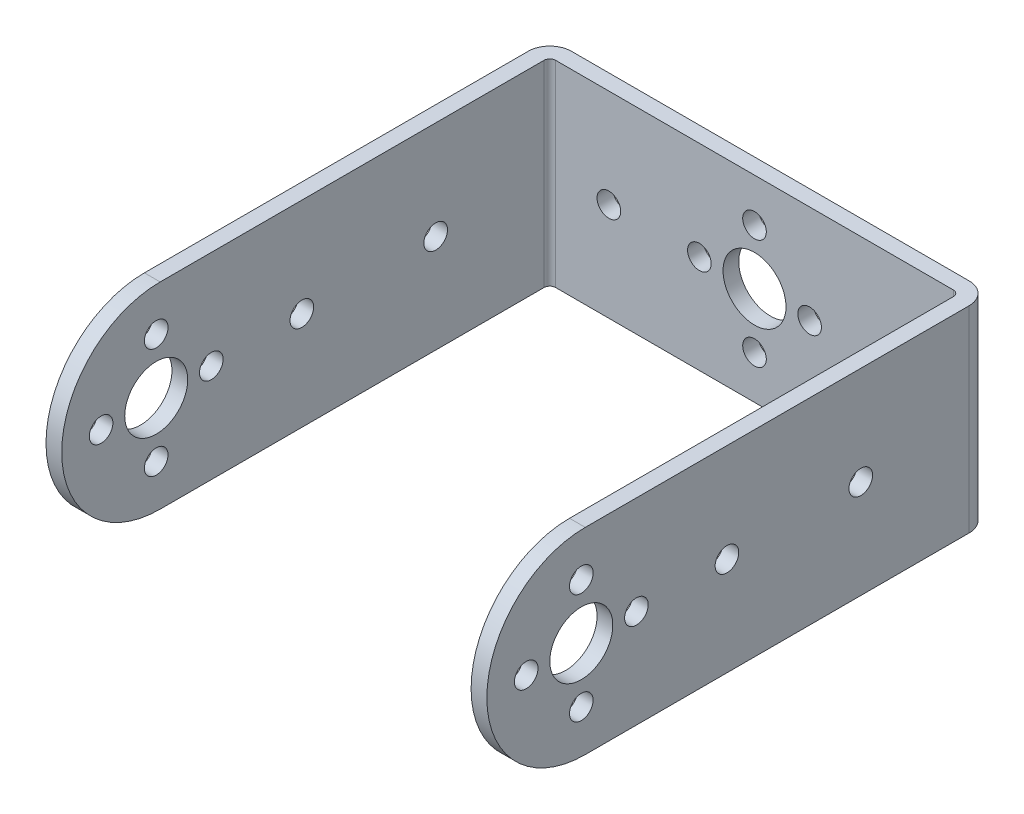
ISO-10303-21;
HEADER;
FILE_DESCRIPTION(('STEP AP214'),'2;1');
FILE_NAME('part.step','',(''),(''),'','','');
FILE_SCHEMA(('AUTOMOTIVE_DESIGN { 1 0 10303 214 1 1 1 1 }'));
ENDSEC;
DATA;
#1=APPLICATION_CONTEXT('core data for automotive mechanical design processes');
#2=APPLICATION_PROTOCOL_DEFINITION('international standard','automotive_design',2000,#1);
#3=PRODUCT_CONTEXT('',#1,'mechanical');
#4=PRODUCT('Part','Part','',(#3));
#5=PRODUCT_RELATED_PRODUCT_CATEGORY('part','',(#4));
#6=PRODUCT_DEFINITION_FORMATION('','',#4);
#7=PRODUCT_DEFINITION_CONTEXT('part definition',#1,'design');
#8=PRODUCT_DEFINITION('design','',#6,#7);
#9=PRODUCT_DEFINITION_SHAPE('','',#8);
#10=(LENGTH_UNIT() NAMED_UNIT(*) SI_UNIT(.MILLI.,.METRE.));
#11=(NAMED_UNIT(*) PLANE_ANGLE_UNIT() SI_UNIT($,.RADIAN.));
#12=(NAMED_UNIT(*) SI_UNIT($,.STERADIAN.) SOLID_ANGLE_UNIT());
#13=UNCERTAINTY_MEASURE_WITH_UNIT(LENGTH_MEASURE(1.E-05),#10,'distance_accuracy_value','');
#14=(GEOMETRIC_REPRESENTATION_CONTEXT(3) GLOBAL_UNCERTAINTY_ASSIGNED_CONTEXT((#13)) GLOBAL_UNIT_ASSIGNED_CONTEXT((#10,
#11,#12)) REPRESENTATION_CONTEXT('',''));
#15=CARTESIAN_POINT('',(0.,0.,0.));
#16=DIRECTION('',(0.,0.,1.));
#17=DIRECTION('',(1.,0.,0.));
#18=AXIS2_PLACEMENT_3D('',#15,#16,#17);
#19=CARTESIAN_POINT('',(1.,0.,0.));
#20=DIRECTION('',(-1.,0.,0.));
#21=DIRECTION('',(0.,0.,1.));
#22=AXIS2_PLACEMENT_3D('',#19,#20,#21);
#23=PLANE('',#22);
#24=CARTESIAN_POINT('',(0.999999999999826,-12.5,49.5000000000002));
#25=DIRECTION('',(-1.,0.,0.));
#26=DIRECTION('',(0.,0.,1.));
#27=AXIS2_PLACEMENT_3D('',#24,#25,#26);
#28=CIRCLE('',#27,12.5);
#29=CARTESIAN_POINT('',(0.999999999999917,-25.,49.5000000000002));
#30=VERTEX_POINT('',#29);
#31=CARTESIAN_POINT('',(0.999999999999826,0.,49.5000000000002));
#32=VERTEX_POINT('',#31);
#33=EDGE_CURVE('E103',#30,#32,#28,.T.);
#34=ORIENTED_EDGE('',*,*,#33,.F.);
#35=DIRECTION('',(0.,0.,1.));
#36=VECTOR('',#35,1.);
#37=CARTESIAN_POINT('',(1.,-25.,0.));
#38=LINE('',#37,#36);
#39=CARTESIAN_POINT('',(1.,-25.,0.736599999999996));
#40=VERTEX_POINT('',#39);
#41=EDGE_CURVE('E111',#40,#30,#38,.T.);
#42=ORIENTED_EDGE('',*,*,#41,.F.);
#43=DIRECTION('',(0.,-1.,0.));
#44=VECTOR('',#43,1.);
#45=CARTESIAN_POINT('',(1.,-25.,0.736599999999999));
#46=LINE('',#45,#44);
#47=CARTESIAN_POINT('',(0.999999999999912,0.,0.736599999999993));
#48=VERTEX_POINT('',#47);
#49=EDGE_CURVE('E133',#40,#48,#46,.F.);
#50=ORIENTED_EDGE('',*,*,#49,.T.);
#51=DIRECTION('',(0.,0.,1.));
#52=VECTOR('',#51,1.);
#53=CARTESIAN_POINT('',(0.999999999999827,0.,68.));
#54=LINE('',#53,#52);
#55=EDGE_CURVE('E113',#32,#48,#54,.F.);
#56=ORIENTED_EDGE('',*,*,#55,.F.);
#57=EDGE_LOOP('',(#34,#42,#50,#56));
#58=FACE_BOUND('',#57,.T.);
#59=CARTESIAN_POINT('',(0.999999999999888,-12.5,31.5000000000002));
#60=DIRECTION('',(-1.,0.,0.));
#61=DIRECTION('',(0.,0.,1.));
#62=AXIS2_PLACEMENT_3D('',#59,#60,#61);
#63=CIRCLE('',#62,1.5);
#64=CARTESIAN_POINT('',(0.999999999999883,-12.5,33.0000000000002));
#65=VERTEX_POINT('',#64);
#66=EDGE_CURVE('E116',#65,#65,#63,.T.);
#67=ORIENTED_EDGE('',*,*,#66,.T.);
#68=EDGE_LOOP('',(#67));
#69=FACE_BOUND('',#68,.T.);
#70=CARTESIAN_POINT('',(0.99999999999985,-12.5,43.0000000000001));
#71=DIRECTION('',(-1.,0.,0.));
#72=DIRECTION('',(0.,0.,1.));
#73=AXIS2_PLACEMENT_3D('',#70,#71,#72);
#74=CIRCLE('',#73,1.5);
#75=CARTESIAN_POINT('',(0.999999999999845,-12.5,44.5000000000001));
#76=VERTEX_POINT('',#75);
#77=EDGE_CURVE('E329',#76,#76,#74,.T.);
#78=ORIENTED_EDGE('',*,*,#77,.T.);
#79=EDGE_LOOP('',(#78));
#80=FACE_BOUND('',#79,.T.);
#81=CARTESIAN_POINT('',(0.999999999999801,-12.5,57.0000000000001));
#82=DIRECTION('',(-1.,0.,0.));
#83=DIRECTION('',(0.,0.,1.));
#84=AXIS2_PLACEMENT_3D('',#81,#82,#83);
#85=CIRCLE('',#84,1.5);
#86=CARTESIAN_POINT('',(0.999999999999796,-12.5,58.5000000000001));
#87=VERTEX_POINT('',#86);
#88=EDGE_CURVE('E333',#87,#87,#85,.T.);
#89=ORIENTED_EDGE('',*,*,#88,.T.);
#90=EDGE_LOOP('',(#89));
#91=FACE_BOUND('',#90,.T.);
#92=CARTESIAN_POINT('',(0.999999999999826,-12.5,50.0000000000001));
#93=DIRECTION('',(-1.,0.,0.));
#94=DIRECTION('',(0.,0.,1.));
#95=AXIS2_PLACEMENT_3D('',#92,#93,#94);
#96=CIRCLE('',#95,4.);
#97=CARTESIAN_POINT('',(0.999999999999812,-12.5,54.0000000000001));
#98=VERTEX_POINT('',#97);
#99=EDGE_CURVE('E337',#98,#98,#96,.T.);
#100=ORIENTED_EDGE('',*,*,#99,.T.);
#101=EDGE_LOOP('',(#100));
#102=FACE_BOUND('',#101,.T.);
#103=CARTESIAN_POINT('',(0.999999999999826,-5.5,50.0000000000001));
#104=DIRECTION('',(-1.,0.,0.));
#105=DIRECTION('',(0.,0.,1.));
#106=AXIS2_PLACEMENT_3D('',#103,#104,#105);
#107=CIRCLE('',#106,1.5);
#108=CARTESIAN_POINT('',(0.99999999999982,-5.5,51.5000000000001));
#109=VERTEX_POINT('',#108);
#110=EDGE_CURVE('E341',#109,#109,#107,.T.);
#111=ORIENTED_EDGE('',*,*,#110,.T.);
#112=EDGE_LOOP('',(#111));
#113=FACE_BOUND('',#112,.T.);
#114=CARTESIAN_POINT('',(0.999999999999829,-19.5,50.0000000000001));
#115=DIRECTION('',(-1.,0.,0.));
#116=DIRECTION('',(0.,0.,1.));
#117=AXIS2_PLACEMENT_3D('',#114,#115,#116);
#118=CIRCLE('',#117,1.5);
#119=CARTESIAN_POINT('',(0.999999999999824,-19.5,51.5000000000001));
#120=VERTEX_POINT('',#119);
#121=EDGE_CURVE('E344',#120,#120,#118,.T.);
#122=ORIENTED_EDGE('',*,*,#121,.T.);
#123=EDGE_LOOP('',(#122));
#124=FACE_BOUND('',#123,.T.);
#125=CARTESIAN_POINT('',(0.999999999999947,-12.5,14.5000000000002));
#126=DIRECTION('',(-1.,0.,0.));
#127=DIRECTION('',(0.,0.,1.));
#128=AXIS2_PLACEMENT_3D('',#125,#126,#127);
#129=CIRCLE('',#128,1.5);
#130=CARTESIAN_POINT('',(0.999999999999942,-12.5,16.0000000000002));
#131=VERTEX_POINT('',#130);
#132=EDGE_CURVE('E20',#131,#131,#129,.T.);
#133=ORIENTED_EDGE('',*,*,#132,.T.);
#134=EDGE_LOOP('',(#133));
#135=FACE_BOUND('',#134,.T.);
#136=ADVANCED_FACE('F17',(#58,#69,#80,#91,#102,#113,#124,#135),#23,.F.);
#137=CARTESIAN_POINT('',(-1.00000000000005,-12.5,14.5000000000002));
#138=DIRECTION('',(-1.,0.,0.));
#139=DIRECTION('',(0.,0.,1.));
#140=AXIS2_PLACEMENT_3D('',#137,#138,#139);
#141=CYLINDRICAL_SURFACE('',#140,1.5);
#142=CARTESIAN_POINT('',(-1.00000000000005,-12.5,14.5000000000002));
#143=DIRECTION('',(-1.,0.,0.));
#144=DIRECTION('',(0.,0.,1.));
#145=AXIS2_PLACEMENT_3D('',#142,#143,#144);
#146=CIRCLE('',#145,1.5);
#147=CARTESIAN_POINT('',(-1.00000000000006,-12.5,16.0000000000002));
#148=VERTEX_POINT('',#147);
#149=EDGE_CURVE('E137',#148,#148,#146,.F.);
#150=ORIENTED_EDGE('',*,*,#149,.F.);
#151=EDGE_LOOP('',(#150));
#152=FACE_BOUND('',#151,.T.);
#153=ORIENTED_EDGE('',*,*,#132,.F.);
#154=EDGE_LOOP('',(#153));
#155=FACE_BOUND('',#154,.T.);
#156=ADVANCED_FACE('F354',(#152,#155),#141,.F.);
#157=CARTESIAN_POINT('',(-1.00000000000017,-19.5,50.0000000000001));
#158=DIRECTION('',(-1.,0.,0.));
#159=DIRECTION('',(0.,0.,1.));
#160=AXIS2_PLACEMENT_3D('',#157,#158,#159);
#161=CYLINDRICAL_SURFACE('',#160,1.5);
#162=CARTESIAN_POINT('',(-1.00000000000017,-19.5,50.0000000000001));
#163=DIRECTION('',(-1.,0.,0.));
#164=DIRECTION('',(0.,0.,1.));
#165=AXIS2_PLACEMENT_3D('',#162,#163,#164);
#166=CIRCLE('',#165,1.5);
#167=CARTESIAN_POINT('',(-1.00000000000018,-19.5,51.5000000000001));
#168=VERTEX_POINT('',#167);
#169=EDGE_CURVE('E319',#168,#168,#166,.F.);
#170=ORIENTED_EDGE('',*,*,#169,.F.);
#171=EDGE_LOOP('',(#170));
#172=FACE_BOUND('',#171,.T.);
#173=ORIENTED_EDGE('',*,*,#121,.F.);
#174=EDGE_LOOP('',(#173));
#175=FACE_BOUND('',#174,.T.);
#176=ADVANCED_FACE('F356',(#172,#175),#161,.F.);
#177=CARTESIAN_POINT('',(-1.00000000000017,-5.5,50.0000000000001));
#178=DIRECTION('',(-1.,0.,0.));
#179=DIRECTION('',(0.,0.,1.));
#180=AXIS2_PLACEMENT_3D('',#177,#178,#179);
#181=CYLINDRICAL_SURFACE('',#180,1.5);
#182=CARTESIAN_POINT('',(-1.00000000000017,-5.5,50.0000000000001));
#183=DIRECTION('',(-1.,0.,0.));
#184=DIRECTION('',(0.,0.,1.));
#185=AXIS2_PLACEMENT_3D('',#182,#183,#184);
#186=CIRCLE('',#185,1.5);
#187=CARTESIAN_POINT('',(-1.00000000000018,-5.5,51.5000000000001));
#188=VERTEX_POINT('',#187);
#189=EDGE_CURVE('E315',#188,#188,#186,.F.);
#190=ORIENTED_EDGE('',*,*,#189,.F.);
#191=EDGE_LOOP('',(#190));
#192=FACE_BOUND('',#191,.T.);
#193=ORIENTED_EDGE('',*,*,#110,.F.);
#194=EDGE_LOOP('',(#193));
#195=FACE_BOUND('',#194,.T.);
#196=ADVANCED_FACE('F363',(#192,#195),#181,.F.);
#197=CARTESIAN_POINT('',(-1.00000000000017,-12.5,50.0000000000001));
#198=DIRECTION('',(-1.,0.,0.));
#199=DIRECTION('',(0.,0.,1.));
#200=AXIS2_PLACEMENT_3D('',#197,#198,#199);
#201=CYLINDRICAL_SURFACE('',#200,4.);
#202=CARTESIAN_POINT('',(-1.00000000000017,-12.5,50.0000000000001));
#203=DIRECTION('',(-1.,0.,0.));
#204=DIRECTION('',(0.,0.,1.));
#205=AXIS2_PLACEMENT_3D('',#202,#203,#204);
#206=CIRCLE('',#205,4.);
#207=CARTESIAN_POINT('',(-1.00000000000019,-12.5,54.0000000000001));
#208=VERTEX_POINT('',#207);
#209=EDGE_CURVE('E311',#208,#208,#206,.F.);
#210=ORIENTED_EDGE('',*,*,#209,.F.);
#211=EDGE_LOOP('',(#210));
#212=FACE_BOUND('',#211,.T.);
#213=ORIENTED_EDGE('',*,*,#99,.F.);
#214=EDGE_LOOP('',(#213));
#215=FACE_BOUND('',#214,.T.);
#216=ADVANCED_FACE('F485',(#212,#215),#201,.F.);
#217=CARTESIAN_POINT('',(-1.0000000000002,-12.5,57.0000000000001));
#218=DIRECTION('',(-1.,0.,0.));
#219=DIRECTION('',(0.,0.,1.));
#220=AXIS2_PLACEMENT_3D('',#217,#218,#219);
#221=CYLINDRICAL_SURFACE('',#220,1.5);
#222=CARTESIAN_POINT('',(-1.0000000000002,-12.5,57.0000000000001));
#223=DIRECTION('',(-1.,0.,0.));
#224=DIRECTION('',(0.,0.,1.));
#225=AXIS2_PLACEMENT_3D('',#222,#223,#224);
#226=CIRCLE('',#225,1.5);
#227=CARTESIAN_POINT('',(-1.0000000000002,-12.5,58.5000000000001));
#228=VERTEX_POINT('',#227);
#229=EDGE_CURVE('E307',#228,#228,#226,.F.);
#230=ORIENTED_EDGE('',*,*,#229,.F.);
#231=EDGE_LOOP('',(#230));
#232=FACE_BOUND('',#231,.T.);
#233=ORIENTED_EDGE('',*,*,#88,.F.);
#234=EDGE_LOOP('',(#233));
#235=FACE_BOUND('',#234,.T.);
#236=ADVANCED_FACE('F481',(#232,#235),#221,.F.);
#237=CARTESIAN_POINT('',(-1.00000000000015,-12.5,43.0000000000001));
#238=DIRECTION('',(-1.,0.,0.));
#239=DIRECTION('',(0.,0.,1.));
#240=AXIS2_PLACEMENT_3D('',#237,#238,#239);
#241=CYLINDRICAL_SURFACE('',#240,1.5);
#242=CARTESIAN_POINT('',(-1.00000000000015,-12.5,43.0000000000001));
#243=DIRECTION('',(-1.,0.,0.));
#244=DIRECTION('',(0.,0.,1.));
#245=AXIS2_PLACEMENT_3D('',#242,#243,#244);
#246=CIRCLE('',#245,1.5);
#247=CARTESIAN_POINT('',(-1.00000000000016,-12.5,44.5000000000001));
#248=VERTEX_POINT('',#247);
#249=EDGE_CURVE('E303',#248,#248,#246,.F.);
#250=ORIENTED_EDGE('',*,*,#249,.F.);
#251=EDGE_LOOP('',(#250));
#252=FACE_BOUND('',#251,.T.);
#253=ORIENTED_EDGE('',*,*,#77,.F.);
#254=EDGE_LOOP('',(#253));
#255=FACE_BOUND('',#254,.T.);
#256=ADVANCED_FACE('F477',(#252,#255),#241,.F.);
#257=CARTESIAN_POINT('',(-1.00000000000011,-12.5,31.5000000000002));
#258=DIRECTION('',(-1.,0.,0.));
#259=DIRECTION('',(0.,0.,1.));
#260=AXIS2_PLACEMENT_3D('',#257,#258,#259);
#261=CYLINDRICAL_SURFACE('',#260,1.5);
#262=CARTESIAN_POINT('',(-1.00000000000011,-12.5,31.5000000000002));
#263=DIRECTION('',(-1.,0.,0.));
#264=DIRECTION('',(0.,0.,1.));
#265=AXIS2_PLACEMENT_3D('',#262,#263,#264);
#266=CIRCLE('',#265,1.5);
#267=CARTESIAN_POINT('',(-1.00000000000012,-12.5,33.0000000000002));
#268=VERTEX_POINT('',#267);
#269=EDGE_CURVE('E299',#268,#268,#266,.F.);
#270=ORIENTED_EDGE('',*,*,#269,.F.);
#271=EDGE_LOOP('',(#270));
#272=FACE_BOUND('',#271,.T.);
#273=ORIENTED_EDGE('',*,*,#66,.F.);
#274=EDGE_LOOP('',(#273));
#275=FACE_BOUND('',#274,.T.);
#276=ADVANCED_FACE('F474',(#272,#275),#261,.F.);
#277=CARTESIAN_POINT('',(-1.00000000000017,-12.5,49.5000000000002));
#278=DIRECTION('',(-1.,0.,0.));
#279=DIRECTION('',(0.,0.,1.));
#280=AXIS2_PLACEMENT_3D('',#277,#278,#279);
#281=CYLINDRICAL_SURFACE('',#280,12.5);
#282=DIRECTION('',(-1.,0.,0.));
#283=VECTOR('',#282,1.);
#284=CARTESIAN_POINT('',(-1.00000000000024,0.,49.5000000000002));
#285=LINE('',#284,#283);
#286=CARTESIAN_POINT('',(-1.00000000000019,0.,49.5000000000002));
#287=VERTEX_POINT('',#286);
#288=EDGE_CURVE('E115',#287,#32,#285,.F.);
#289=ORIENTED_EDGE('',*,*,#288,.F.);
#290=CARTESIAN_POINT('',(-1.0000000000002,-12.5,49.5000000000002));
#291=DIRECTION('',(-1.,0.,0.));
#292=DIRECTION('',(0.,0.,1.));
#293=AXIS2_PLACEMENT_3D('',#290,#291,#292);
#294=CIRCLE('',#293,12.5);
#295=CARTESIAN_POINT('',(-1.00000000000017,-25.,49.5000000000002));
#296=VERTEX_POINT('',#295);
#297=EDGE_CURVE('E131',#296,#287,#294,.T.);
#298=ORIENTED_EDGE('',*,*,#297,.F.);
#299=DIRECTION('',(1.,0.,0.));
#300=VECTOR('',#299,1.);
#301=CARTESIAN_POINT('',(-0.999999999999997,-25.,49.5000000000002));
#302=LINE('',#301,#300);
#303=EDGE_CURVE('E123',#30,#296,#302,.F.);
#304=ORIENTED_EDGE('',*,*,#303,.F.);
#305=ORIENTED_EDGE('',*,*,#33,.T.);
#306=EDGE_LOOP('',(#289,#298,#304,#305));
#307=FACE_BOUND('',#306,.T.);
#308=ADVANCED_FACE('F130',(#307),#281,.T.);
#309=CARTESIAN_POINT('',(1.7366,-25.,0.736600000000001));
#310=DIRECTION('',(0.,-1.,0.));
#311=DIRECTION('',(1.,0.,0.));
#312=AXIS2_PLACEMENT_3D('',#309,#310,#311);
#313=CYLINDRICAL_SURFACE('',#312,0.736599999999998);
#314=CARTESIAN_POINT('',(1.7366,0.,0.7366));
#315=DIRECTION('',(0.,-1.,0.));
#316=DIRECTION('',(1.,0.,0.));
#317=AXIS2_PLACEMENT_3D('',#314,#315,#316);
#318=CIRCLE('',#317,0.736599999999998);
#319=CARTESIAN_POINT('',(1.73659999999999,0.,0.));
#320=VERTEX_POINT('',#319);
#321=EDGE_CURVE('E292',#48,#320,#318,.T.);
#322=ORIENTED_EDGE('',*,*,#321,.F.);
#323=ORIENTED_EDGE('',*,*,#49,.F.);
#324=CARTESIAN_POINT('',(1.7366,-25.,0.736600000000001));
#325=DIRECTION('',(0.,-1.,0.));
#326=DIRECTION('',(1.,0.,0.));
#327=AXIS2_PLACEMENT_3D('',#324,#325,#326);
#328=CIRCLE('',#327,0.736599999999998);
#329=CARTESIAN_POINT('',(1.7366,-25.,0.));
#330=VERTEX_POINT('',#329);
#331=EDGE_CURVE('E127',#40,#330,#328,.T.);
#332=ORIENTED_EDGE('',*,*,#331,.T.);
#333=DIRECTION('',(0.,1.,0.));
#334=VECTOR('',#333,1.);
#335=CARTESIAN_POINT('',(1.73659999999999,0.,0.));
#336=LINE('',#335,#334);
#337=EDGE_CURVE('E289',#320,#330,#336,.F.);
#338=ORIENTED_EDGE('',*,*,#337,.F.);
#339=EDGE_LOOP('',(#322,#323,#332,#338));
#340=FACE_BOUND('',#339,.T.);
#341=ADVANCED_FACE('F467',(#340),#313,.F.);
#342=CARTESIAN_POINT('',(-1.,0.,0.));
#343=DIRECTION('',(-1.,0.,0.));
#344=DIRECTION('',(0.,0.,1.));
#345=AXIS2_PLACEMENT_3D('',#342,#343,#344);
#346=PLANE('',#345);
#347=DIRECTION('',(0.,0.,1.));
#348=VECTOR('',#347,1.);
#349=CARTESIAN_POINT('',(-1.,0.,0.));
#350=LINE('',#349,#348);
#351=CARTESIAN_POINT('',(-1.,0.,0.73659999999999));
#352=VERTEX_POINT('',#351);
#353=EDGE_CURVE('E295',#287,#352,#350,.F.);
#354=ORIENTED_EDGE('',*,*,#353,.T.);
#355=DIRECTION('',(0.,-1.,0.));
#356=VECTOR('',#355,1.);
#357=CARTESIAN_POINT('',(-0.999999999999995,-25.,0.736599999999992));
#358=LINE('',#357,#356);
#359=CARTESIAN_POINT('',(-0.999999999999997,-25.,0.736599999999992));
#360=VERTEX_POINT('',#359);
#361=EDGE_CURVE('E257',#360,#352,#358,.F.);
#362=ORIENTED_EDGE('',*,*,#361,.F.);
#363=DIRECTION('',(0.,0.,1.));
#364=VECTOR('',#363,1.);
#365=CARTESIAN_POINT('',(-0.999999999999997,-25.,0.));
#366=LINE('',#365,#364);
#367=EDGE_CURVE('E298',#360,#296,#366,.T.);
#368=ORIENTED_EDGE('',*,*,#367,.T.);
#369=ORIENTED_EDGE('',*,*,#297,.T.);
#370=EDGE_LOOP('',(#354,#362,#368,#369));
#371=FACE_BOUND('',#370,.T.);
#372=ORIENTED_EDGE('',*,*,#269,.T.);
#373=EDGE_LOOP('',(#372));
#374=FACE_BOUND('',#373,.T.);
#375=ORIENTED_EDGE('',*,*,#249,.T.);
#376=EDGE_LOOP('',(#375));
#377=FACE_BOUND('',#376,.T.);
#378=ORIENTED_EDGE('',*,*,#229,.T.);
#379=EDGE_LOOP('',(#378));
#380=FACE_BOUND('',#379,.T.);
#381=ORIENTED_EDGE('',*,*,#209,.T.);
#382=EDGE_LOOP('',(#381));
#383=FACE_BOUND('',#382,.T.);
#384=ORIENTED_EDGE('',*,*,#189,.T.);
#385=EDGE_LOOP('',(#384));
#386=FACE_BOUND('',#385,.T.);
#387=ORIENTED_EDGE('',*,*,#169,.T.);
#388=EDGE_LOOP('',(#387));
#389=FACE_BOUND('',#388,.T.);
#390=ORIENTED_EDGE('',*,*,#149,.T.);
#391=EDGE_LOOP('',(#390));
#392=FACE_BOUND('',#391,.T.);
#393=ADVANCED_FACE('F463',(#371,#374,#377,#380,#383,#386,#389,#392),#346,.T.);
#394=CARTESIAN_POINT('',(0.,0.,0.));
#395=DIRECTION('',(0.,0.,1.));
#396=DIRECTION('',(1.,0.,0.));
#397=AXIS2_PLACEMENT_3D('',#394,#395,#396);
#398=PLANE('',#397);
#399=DIRECTION('',(1.,0.,0.));
#400=VECTOR('',#399,1.);
#401=CARTESIAN_POINT('',(0.,0.,0.));
#402=LINE('',#401,#400);
#403=CARTESIAN_POINT('',(52.2634,0.,0.));
#404=VERTEX_POINT('',#403);
#405=EDGE_CURVE('E256',#320,#404,#402,.T.);
#406=ORIENTED_EDGE('',*,*,#405,.F.);
#407=ORIENTED_EDGE('',*,*,#337,.T.);
#408=DIRECTION('',(1.,0.,0.));
#409=VECTOR('',#408,1.);
#410=CARTESIAN_POINT('',(0.,-25.,0.));
#411=LINE('',#410,#409);
#412=CARTESIAN_POINT('',(52.2634,-25.,0.));
#413=VERTEX_POINT('',#412);
#414=EDGE_CURVE('E762',#413,#330,#411,.F.);
#415=ORIENTED_EDGE('',*,*,#414,.F.);
#416=DIRECTION('',(0.,1.,0.));
#417=VECTOR('',#416,1.);
#418=CARTESIAN_POINT('',(52.2634,0.,0.));
#419=LINE('',#418,#417);
#420=EDGE_CURVE('E252',#413,#404,#419,.T.);
#421=ORIENTED_EDGE('',*,*,#420,.T.);
#422=EDGE_LOOP('',(#406,#407,#415,#421));
#423=FACE_BOUND('',#422,.T.);
#424=CARTESIAN_POINT('',(27.,-12.5,0.));
#425=DIRECTION('',(0.,0.,1.));
#426=DIRECTION('',(1.,0.,0.));
#427=AXIS2_PLACEMENT_3D('',#424,#425,#426);
#428=CIRCLE('',#427,4.);
#429=CARTESIAN_POINT('',(31.,-12.5,0.));
#430=VERTEX_POINT('',#429);
#431=EDGE_CURVE('E261',#430,#430,#428,.F.);
#432=ORIENTED_EDGE('',*,*,#431,.T.);
#433=EDGE_LOOP('',(#432));
#434=FACE_BOUND('',#433,.T.);
#435=CARTESIAN_POINT('',(27.,-5.5,0.));
#436=DIRECTION('',(0.,0.,1.));
#437=DIRECTION('',(1.,0.,0.));
#438=AXIS2_PLACEMENT_3D('',#435,#436,#437);
#439=CIRCLE('',#438,1.5);
#440=CARTESIAN_POINT('',(28.5,-5.5,0.));
#441=VERTEX_POINT('',#440);
#442=EDGE_CURVE('E265',#441,#441,#439,.F.);
#443=ORIENTED_EDGE('',*,*,#442,.T.);
#444=EDGE_LOOP('',(#443));
#445=FACE_BOUND('',#444,.T.);
#446=CARTESIAN_POINT('',(27.,-19.5,0.));
#447=DIRECTION('',(0.,0.,1.));
#448=DIRECTION('',(1.,0.,0.));
#449=AXIS2_PLACEMENT_3D('',#446,#447,#448);
#450=CIRCLE('',#449,1.5);
#451=CARTESIAN_POINT('',(28.5,-19.5,0.));
#452=VERTEX_POINT('',#451);
#453=EDGE_CURVE('E269',#452,#452,#450,.F.);
#454=ORIENTED_EDGE('',*,*,#453,.T.);
#455=EDGE_LOOP('',(#454));
#456=FACE_BOUND('',#455,.T.);
#457=CARTESIAN_POINT('',(34.,-12.5,0.));
#458=DIRECTION('',(0.,0.,1.));
#459=DIRECTION('',(1.,0.,0.));
#460=AXIS2_PLACEMENT_3D('',#457,#458,#459);
#461=CIRCLE('',#460,1.5);
#462=CARTESIAN_POINT('',(35.5,-12.5,0.));
#463=VERTEX_POINT('',#462);
#464=EDGE_CURVE('E273',#463,#463,#461,.F.);
#465=ORIENTED_EDGE('',*,*,#464,.T.);
#466=EDGE_LOOP('',(#465));
#467=FACE_BOUND('',#466,.T.);
#468=CARTESIAN_POINT('',(20.,-12.5,0.));
#469=DIRECTION('',(0.,0.,1.));
#470=DIRECTION('',(1.,0.,0.));
#471=AXIS2_PLACEMENT_3D('',#468,#469,#470);
#472=CIRCLE('',#471,1.5);
#473=CARTESIAN_POINT('',(21.5,-12.5,0.));
#474=VERTEX_POINT('',#473);
#475=EDGE_CURVE('E277',#474,#474,#472,.F.);
#476=ORIENTED_EDGE('',*,*,#475,.T.);
#477=EDGE_LOOP('',(#476));
#478=FACE_BOUND('',#477,.T.);
#479=CARTESIAN_POINT('',(45.5,-12.5,0.));
#480=DIRECTION('',(0.,0.,1.));
#481=DIRECTION('',(1.,0.,0.));
#482=AXIS2_PLACEMENT_3D('',#479,#480,#481);
#483=CIRCLE('',#482,1.5);
#484=CARTESIAN_POINT('',(47.,-12.5,0.));
#485=VERTEX_POINT('',#484);
#486=EDGE_CURVE('E281',#485,#485,#483,.F.);
#487=ORIENTED_EDGE('',*,*,#486,.T.);
#488=EDGE_LOOP('',(#487));
#489=FACE_BOUND('',#488,.T.);
#490=CARTESIAN_POINT('',(8.5,-12.5,0.));
#491=DIRECTION('',(0.,0.,1.));
#492=DIRECTION('',(1.,0.,0.));
#493=AXIS2_PLACEMENT_3D('',#490,#491,#492);
#494=CIRCLE('',#493,1.5);
#495=CARTESIAN_POINT('',(10.,-12.5,0.));
#496=VERTEX_POINT('',#495);
#497=EDGE_CURVE('E285',#496,#496,#494,.F.);
#498=ORIENTED_EDGE('',*,*,#497,.T.);
#499=EDGE_LOOP('',(#498));
#500=FACE_BOUND('',#499,.T.);
#501=ADVANCED_FACE('F459',(#423,#434,#445,#456,#467,#478,#489,#500),#398,.T.);
#502=CARTESIAN_POINT('',(8.5,-12.5,-2.));
#503=DIRECTION('',(0.,0.,1.));
#504=DIRECTION('',(1.,0.,0.));
#505=AXIS2_PLACEMENT_3D('',#502,#503,#504);
#506=CYLINDRICAL_SURFACE('',#505,1.5);
#507=CARTESIAN_POINT('',(8.5,-12.5,-2.));
#508=DIRECTION('',(0.,0.,1.));
#509=DIRECTION('',(1.,0.,0.));
#510=AXIS2_PLACEMENT_3D('',#507,#508,#509);
#511=CIRCLE('',#510,1.5);
#512=CARTESIAN_POINT('',(10.,-12.5,-2.));
#513=VERTEX_POINT('',#512);
#514=EDGE_CURVE('E248',#513,#513,#511,.F.);
#515=ORIENTED_EDGE('',*,*,#514,.T.);
#516=EDGE_LOOP('',(#515));
#517=FACE_BOUND('',#516,.T.);
#518=ORIENTED_EDGE('',*,*,#497,.F.);
#519=EDGE_LOOP('',(#518));
#520=FACE_BOUND('',#519,.T.);
#521=ADVANCED_FACE('F455',(#517,#520),#506,.F.);
#522=CARTESIAN_POINT('',(45.5,-12.5,-2.));
#523=DIRECTION('',(0.,0.,1.));
#524=DIRECTION('',(1.,0.,0.));
#525=AXIS2_PLACEMENT_3D('',#522,#523,#524);
#526=CYLINDRICAL_SURFACE('',#525,1.5);
#527=CARTESIAN_POINT('',(45.5,-12.5,-2.));
#528=DIRECTION('',(0.,0.,1.));
#529=DIRECTION('',(1.,0.,0.));
#530=AXIS2_PLACEMENT_3D('',#527,#528,#529);
#531=CIRCLE('',#530,1.5);
#532=CARTESIAN_POINT('',(47.,-12.5,-2.));
#533=VERTEX_POINT('',#532);
#534=EDGE_CURVE('E244',#533,#533,#531,.F.);
#535=ORIENTED_EDGE('',*,*,#534,.T.);
#536=EDGE_LOOP('',(#535));
#537=FACE_BOUND('',#536,.T.);
#538=ORIENTED_EDGE('',*,*,#486,.F.);
#539=EDGE_LOOP('',(#538));
#540=FACE_BOUND('',#539,.T.);
#541=ADVANCED_FACE('F451',(#537,#540),#526,.F.);
#542=CARTESIAN_POINT('',(20.,-12.5,-2.));
#543=DIRECTION('',(0.,0.,1.));
#544=DIRECTION('',(1.,0.,0.));
#545=AXIS2_PLACEMENT_3D('',#542,#543,#544);
#546=CYLINDRICAL_SURFACE('',#545,1.5);
#547=CARTESIAN_POINT('',(20.,-12.5,-2.));
#548=DIRECTION('',(0.,0.,1.));
#549=DIRECTION('',(1.,0.,0.));
#550=AXIS2_PLACEMENT_3D('',#547,#548,#549);
#551=CIRCLE('',#550,1.5);
#552=CARTESIAN_POINT('',(21.5,-12.5,-2.));
#553=VERTEX_POINT('',#552);
#554=EDGE_CURVE('E240',#553,#553,#551,.F.);
#555=ORIENTED_EDGE('',*,*,#554,.T.);
#556=EDGE_LOOP('',(#555));
#557=FACE_BOUND('',#556,.T.);
#558=ORIENTED_EDGE('',*,*,#475,.F.);
#559=EDGE_LOOP('',(#558));
#560=FACE_BOUND('',#559,.T.);
#561=ADVANCED_FACE('F447',(#557,#560),#546,.F.);
#562=CARTESIAN_POINT('',(34.,-12.5,-2.));
#563=DIRECTION('',(0.,0.,1.));
#564=DIRECTION('',(1.,0.,0.));
#565=AXIS2_PLACEMENT_3D('',#562,#563,#564);
#566=CYLINDRICAL_SURFACE('',#565,1.5);
#567=CARTESIAN_POINT('',(34.,-12.5,-2.));
#568=DIRECTION('',(0.,0.,1.));
#569=DIRECTION('',(1.,0.,0.));
#570=AXIS2_PLACEMENT_3D('',#567,#568,#569);
#571=CIRCLE('',#570,1.5);
#572=CARTESIAN_POINT('',(35.5,-12.5,-2.));
#573=VERTEX_POINT('',#572);
#574=EDGE_CURVE('E236',#573,#573,#571,.F.);
#575=ORIENTED_EDGE('',*,*,#574,.T.);
#576=EDGE_LOOP('',(#575));
#577=FACE_BOUND('',#576,.T.);
#578=ORIENTED_EDGE('',*,*,#464,.F.);
#579=EDGE_LOOP('',(#578));
#580=FACE_BOUND('',#579,.T.);
#581=ADVANCED_FACE('F443',(#577,#580),#566,.F.);
#582=CARTESIAN_POINT('',(27.,-19.5,-2.));
#583=DIRECTION('',(0.,0.,1.));
#584=DIRECTION('',(1.,0.,0.));
#585=AXIS2_PLACEMENT_3D('',#582,#583,#584);
#586=CYLINDRICAL_SURFACE('',#585,1.5);
#587=CARTESIAN_POINT('',(27.,-19.5,-2.));
#588=DIRECTION('',(0.,0.,1.));
#589=DIRECTION('',(1.,0.,0.));
#590=AXIS2_PLACEMENT_3D('',#587,#588,#589);
#591=CIRCLE('',#590,1.5);
#592=CARTESIAN_POINT('',(28.5,-19.5,-2.));
#593=VERTEX_POINT('',#592);
#594=EDGE_CURVE('E232',#593,#593,#591,.F.);
#595=ORIENTED_EDGE('',*,*,#594,.T.);
#596=EDGE_LOOP('',(#595));
#597=FACE_BOUND('',#596,.T.);
#598=ORIENTED_EDGE('',*,*,#453,.F.);
#599=EDGE_LOOP('',(#598));
#600=FACE_BOUND('',#599,.T.);
#601=ADVANCED_FACE('F439',(#597,#600),#586,.F.);
#602=CARTESIAN_POINT('',(27.,-5.5,-2.));
#603=DIRECTION('',(0.,0.,1.));
#604=DIRECTION('',(1.,0.,0.));
#605=AXIS2_PLACEMENT_3D('',#602,#603,#604);
#606=CYLINDRICAL_SURFACE('',#605,1.5);
#607=CARTESIAN_POINT('',(27.,-5.5,-2.));
#608=DIRECTION('',(0.,0.,1.));
#609=DIRECTION('',(1.,0.,0.));
#610=AXIS2_PLACEMENT_3D('',#607,#608,#609);
#611=CIRCLE('',#610,1.5);
#612=CARTESIAN_POINT('',(28.5,-5.5,-2.));
#613=VERTEX_POINT('',#612);
#614=EDGE_CURVE('E228',#613,#613,#611,.F.);
#615=ORIENTED_EDGE('',*,*,#614,.T.);
#616=EDGE_LOOP('',(#615));
#617=FACE_BOUND('',#616,.T.);
#618=ORIENTED_EDGE('',*,*,#442,.F.);
#619=EDGE_LOOP('',(#618));
#620=FACE_BOUND('',#619,.T.);
#621=ADVANCED_FACE('F435',(#617,#620),#606,.F.);
#622=CARTESIAN_POINT('',(27.,-12.5,-2.));
#623=DIRECTION('',(0.,0.,1.));
#624=DIRECTION('',(1.,0.,0.));
#625=AXIS2_PLACEMENT_3D('',#622,#623,#624);
#626=CYLINDRICAL_SURFACE('',#625,4.);
#627=CARTESIAN_POINT('',(27.,-12.5,-2.));
#628=DIRECTION('',(0.,0.,1.));
#629=DIRECTION('',(1.,0.,0.));
#630=AXIS2_PLACEMENT_3D('',#627,#628,#629);
#631=CIRCLE('',#630,4.);
#632=CARTESIAN_POINT('',(31.,-12.5,-2.));
#633=VERTEX_POINT('',#632);
#634=EDGE_CURVE('E223',#633,#633,#631,.F.);
#635=ORIENTED_EDGE('',*,*,#634,.T.);
#636=EDGE_LOOP('',(#635));
#637=FACE_BOUND('',#636,.T.);
#638=ORIENTED_EDGE('',*,*,#431,.F.);
#639=EDGE_LOOP('',(#638));
#640=FACE_BOUND('',#639,.T.);
#641=ADVANCED_FACE('F431',(#637,#640),#626,.F.);
#642=CARTESIAN_POINT('',(1.7366,-25.,0.736600000000001));
#643=DIRECTION('',(0.,-1.,0.));
#644=DIRECTION('',(1.,0.,0.));
#645=AXIS2_PLACEMENT_3D('',#642,#643,#644);
#646=CYLINDRICAL_SURFACE('',#645,2.7366);
#647=ORIENTED_EDGE('',*,*,#361,.T.);
#648=CARTESIAN_POINT('',(1.7366,0.,0.7366));
#649=DIRECTION('',(0.,-1.,0.));
#650=DIRECTION('',(1.,0.,0.));
#651=AXIS2_PLACEMENT_3D('',#648,#649,#650);
#652=CIRCLE('',#651,2.7366);
#653=CARTESIAN_POINT('',(1.73659999999999,0.,-2.));
#654=VERTEX_POINT('',#653);
#655=EDGE_CURVE('E253',#352,#654,#652,.T.);
#656=ORIENTED_EDGE('',*,*,#655,.T.);
#657=DIRECTION('',(0.,1.,0.));
#658=VECTOR('',#657,1.);
#659=CARTESIAN_POINT('',(1.73659999999999,0.,-2.));
#660=LINE('',#659,#658);
#661=CARTESIAN_POINT('',(1.7366,-25.,-2.));
#662=VERTEX_POINT('',#661);
#663=EDGE_CURVE('E756',#654,#662,#660,.F.);
#664=ORIENTED_EDGE('',*,*,#663,.T.);
#665=CARTESIAN_POINT('',(1.7366,-25.,0.736600000000001));
#666=DIRECTION('',(0.,-1.,0.));
#667=DIRECTION('',(1.,0.,0.));
#668=AXIS2_PLACEMENT_3D('',#665,#666,#667);
#669=CIRCLE('',#668,2.7366);
#670=EDGE_CURVE('E258',#662,#360,#669,.F.);
#671=ORIENTED_EDGE('',*,*,#670,.T.);
#672=EDGE_LOOP('',(#647,#656,#664,#671));
#673=FACE_BOUND('',#672,.T.);
#674=ADVANCED_FACE('F427',(#673),#646,.T.);
#675=CARTESIAN_POINT('',(52.2634,0.,0.7366));
#676=DIRECTION('',(0.,1.,0.));
#677=DIRECTION('',(0.,0.,1.));
#678=AXIS2_PLACEMENT_3D('',#675,#676,#677);
#679=CYLINDRICAL_SURFACE('',#678,0.736599999999997);
#680=CARTESIAN_POINT('',(52.2634,-25.,0.7366));
#681=DIRECTION('',(0.,1.,0.));
#682=DIRECTION('',(0.,0.,1.));
#683=AXIS2_PLACEMENT_3D('',#680,#681,#682);
#684=CIRCLE('',#683,0.736599999999997);
#685=CARTESIAN_POINT('',(53.0000000000001,-25.,0.736599999999998));
#686=VERTEX_POINT('',#685);
#687=EDGE_CURVE('E214',#686,#413,#684,.T.);
#688=ORIENTED_EDGE('',*,*,#687,.F.);
#689=DIRECTION('',(0.,1.,0.));
#690=VECTOR('',#689,1.);
#691=CARTESIAN_POINT('',(53.,0.,0.736599999999997));
#692=LINE('',#691,#690);
#693=CARTESIAN_POINT('',(53.,0.,0.736599999999995));
#694=VERTEX_POINT('',#693);
#695=EDGE_CURVE('E213',#694,#686,#692,.F.);
#696=ORIENTED_EDGE('',*,*,#695,.F.);
#697=CARTESIAN_POINT('',(52.2634,0.,0.7366));
#698=DIRECTION('',(0.,1.,0.));
#699=DIRECTION('',(0.,0.,1.));
#700=AXIS2_PLACEMENT_3D('',#697,#698,#699);
#701=CIRCLE('',#700,0.736599999999997);
#702=EDGE_CURVE('E218',#694,#404,#701,.T.);
#703=ORIENTED_EDGE('',*,*,#702,.T.);
#704=ORIENTED_EDGE('',*,*,#420,.F.);
#705=EDGE_LOOP('',(#688,#696,#703,#704));
#706=FACE_BOUND('',#705,.T.);
#707=ADVANCED_FACE('F423',(#706),#679,.F.);
#708=CARTESIAN_POINT('',(0.,0.,-2.));
#709=DIRECTION('',(0.,0.,1.));
#710=DIRECTION('',(1.,0.,0.));
#711=AXIS2_PLACEMENT_3D('',#708,#709,#710);
#712=PLANE('',#711);
#713=DIRECTION('',(1.,0.,0.));
#714=VECTOR('',#713,1.);
#715=CARTESIAN_POINT('',(0.,-25.,-2.));
#716=LINE('',#715,#714);
#717=CARTESIAN_POINT('',(52.2634,-25.,-2.));
#718=VERTEX_POINT('',#717);
#719=EDGE_CURVE('E222',#662,#718,#716,.T.);
#720=ORIENTED_EDGE('',*,*,#719,.F.);
#721=ORIENTED_EDGE('',*,*,#663,.F.);
#722=DIRECTION('',(1.,0.,0.));
#723=VECTOR('',#722,1.);
#724=CARTESIAN_POINT('',(0.,0.,-2.));
#725=LINE('',#724,#723);
#726=CARTESIAN_POINT('',(52.2634,0.,-2.));
#727=VERTEX_POINT('',#726);
#728=EDGE_CURVE('E227',#727,#654,#725,.F.);
#729=ORIENTED_EDGE('',*,*,#728,.F.);
#730=DIRECTION('',(0.,1.,0.));
#731=VECTOR('',#730,1.);
#732=CARTESIAN_POINT('',(52.2634,0.,-2.));
#733=LINE('',#732,#731);
#734=EDGE_CURVE('E183',#718,#727,#733,.T.);
#735=ORIENTED_EDGE('',*,*,#734,.F.);
#736=EDGE_LOOP('',(#720,#721,#729,#735));
#737=FACE_BOUND('',#736,.T.);
#738=ORIENTED_EDGE('',*,*,#634,.F.);
#739=EDGE_LOOP('',(#738));
#740=FACE_BOUND('',#739,.T.);
#741=ORIENTED_EDGE('',*,*,#614,.F.);
#742=EDGE_LOOP('',(#741));
#743=FACE_BOUND('',#742,.T.);
#744=ORIENTED_EDGE('',*,*,#594,.F.);
#745=EDGE_LOOP('',(#744));
#746=FACE_BOUND('',#745,.T.);
#747=ORIENTED_EDGE('',*,*,#574,.F.);
#748=EDGE_LOOP('',(#747));
#749=FACE_BOUND('',#748,.T.);
#750=ORIENTED_EDGE('',*,*,#554,.F.);
#751=EDGE_LOOP('',(#750));
#752=FACE_BOUND('',#751,.T.);
#753=ORIENTED_EDGE('',*,*,#534,.F.);
#754=EDGE_LOOP('',(#753));
#755=FACE_BOUND('',#754,.T.);
#756=ORIENTED_EDGE('',*,*,#514,.F.);
#757=EDGE_LOOP('',(#756));
#758=FACE_BOUND('',#757,.T.);
#759=ADVANCED_FACE('F419',(#737,#740,#743,#746,#749,#752,#755,#758),#712,.F.);
#760=CARTESIAN_POINT('',(53.,0.,-1.87350135405495E-13));
#761=DIRECTION('',(-1.,0.,0.));
#762=DIRECTION('',(0.,0.,1.));
#763=AXIS2_PLACEMENT_3D('',#760,#761,#762);
#764=PLANE('',#763);
#765=DIRECTION('',(0.,0.,1.));
#766=VECTOR('',#765,1.);
#767=CARTESIAN_POINT('',(53.,0.,68.));
#768=LINE('',#767,#766);
#769=CARTESIAN_POINT('',(53.0000000000001,0.,49.5));
#770=VERTEX_POINT('',#769);
#771=EDGE_CURVE('E188',#694,#770,#768,.T.);
#772=ORIENTED_EDGE('',*,*,#771,.F.);
#773=ORIENTED_EDGE('',*,*,#695,.T.);
#774=DIRECTION('',(0.,0.,-1.));
#775=VECTOR('',#774,1.);
#776=CARTESIAN_POINT('',(53.0000000000002,-25.,0.));
#777=LINE('',#776,#775);
#778=CARTESIAN_POINT('',(53.0000000000002,-25.,49.5));
#779=VERTEX_POINT('',#778);
#780=EDGE_CURVE('E179',#779,#686,#777,.T.);
#781=ORIENTED_EDGE('',*,*,#780,.F.);
#782=CARTESIAN_POINT('',(53.0000000000002,-12.5,49.5));
#783=DIRECTION('',(-1.,0.,0.));
#784=DIRECTION('',(0.,0.,1.));
#785=AXIS2_PLACEMENT_3D('',#782,#783,#784);
#786=CIRCLE('',#785,12.5);
#787=EDGE_CURVE('E171',#770,#779,#786,.F.);
#788=ORIENTED_EDGE('',*,*,#787,.F.);
#789=EDGE_LOOP('',(#772,#773,#781,#788));
#790=FACE_BOUND('',#789,.T.);
#791=CARTESIAN_POINT('',(53.0000000000001,-12.5,31.5));
#792=DIRECTION('',(-1.,0.,0.));
#793=DIRECTION('',(0.,0.,1.));
#794=AXIS2_PLACEMENT_3D('',#791,#792,#793);
#795=CIRCLE('',#794,1.5);
#796=CARTESIAN_POINT('',(53.0000000000001,-12.5,33.));
#797=VERTEX_POINT('',#796);
#798=EDGE_CURVE('E184',#797,#797,#795,.F.);
#799=ORIENTED_EDGE('',*,*,#798,.T.);
#800=EDGE_LOOP('',(#799));
#801=FACE_BOUND('',#800,.T.);
#802=CARTESIAN_POINT('',(53.0000000000001,-12.5,42.9999999999999));
#803=DIRECTION('',(-1.,0.,0.));
#804=DIRECTION('',(0.,0.,1.));
#805=AXIS2_PLACEMENT_3D('',#802,#803,#804);
#806=CIRCLE('',#805,1.5);
#807=CARTESIAN_POINT('',(53.0000000000002,-12.5,44.4999999999999));
#808=VERTEX_POINT('',#807);
#809=EDGE_CURVE('E189',#808,#808,#806,.F.);
#810=ORIENTED_EDGE('',*,*,#809,.T.);
#811=EDGE_LOOP('',(#810));
#812=FACE_BOUND('',#811,.T.);
#813=CARTESIAN_POINT('',(53.0000000000002,-12.5,56.9999999999999));
#814=DIRECTION('',(-1.,0.,0.));
#815=DIRECTION('',(0.,0.,1.));
#816=AXIS2_PLACEMENT_3D('',#813,#814,#815);
#817=CIRCLE('',#816,1.5);
#818=CARTESIAN_POINT('',(53.0000000000002,-12.5,58.4999999999999));
#819=VERTEX_POINT('',#818);
#820=EDGE_CURVE('E193',#819,#819,#817,.F.);
#821=ORIENTED_EDGE('',*,*,#820,.T.);
#822=EDGE_LOOP('',(#821));
#823=FACE_BOUND('',#822,.T.);
#824=CARTESIAN_POINT('',(53.0000000000002,-12.5,49.9999999999999));
#825=DIRECTION('',(-1.,0.,0.));
#826=DIRECTION('',(0.,0.,1.));
#827=AXIS2_PLACEMENT_3D('',#824,#825,#826);
#828=CIRCLE('',#827,4.);
#829=CARTESIAN_POINT('',(53.0000000000002,-12.5,53.9999999999999));
#830=VERTEX_POINT('',#829);
#831=EDGE_CURVE('E197',#830,#830,#828,.F.);
#832=ORIENTED_EDGE('',*,*,#831,.T.);
#833=EDGE_LOOP('',(#832));
#834=FACE_BOUND('',#833,.T.);
#835=CARTESIAN_POINT('',(53.0000000000002,-5.5,49.9999999999999));
#836=DIRECTION('',(-1.,0.,0.));
#837=DIRECTION('',(0.,0.,1.));
#838=AXIS2_PLACEMENT_3D('',#835,#836,#837);
#839=CIRCLE('',#838,1.5);
#840=CARTESIAN_POINT('',(53.0000000000002,-5.5,51.4999999999999));
#841=VERTEX_POINT('',#840);
#842=EDGE_CURVE('E201',#841,#841,#839,.F.);
#843=ORIENTED_EDGE('',*,*,#842,.T.);
#844=EDGE_LOOP('',(#843));
#845=FACE_BOUND('',#844,.T.);
#846=CARTESIAN_POINT('',(53.0000000000002,-19.5,49.9999999999999));
#847=DIRECTION('',(-1.,0.,0.));
#848=DIRECTION('',(0.,0.,1.));
#849=AXIS2_PLACEMENT_3D('',#846,#847,#848);
#850=CIRCLE('',#849,1.5);
#851=CARTESIAN_POINT('',(53.0000000000002,-19.5,51.4999999999999));
#852=VERTEX_POINT('',#851);
#853=EDGE_CURVE('E205',#852,#852,#850,.F.);
#854=ORIENTED_EDGE('',*,*,#853,.T.);
#855=EDGE_LOOP('',(#854));
#856=FACE_BOUND('',#855,.T.);
#857=CARTESIAN_POINT('',(53.0000000000001,-12.5,14.5));
#858=DIRECTION('',(-1.,0.,0.));
#859=DIRECTION('',(0.,0.,1.));
#860=AXIS2_PLACEMENT_3D('',#857,#858,#859);
#861=CIRCLE('',#860,1.5);
#862=CARTESIAN_POINT('',(53.0000000000001,-12.5,16.));
#863=VERTEX_POINT('',#862);
#864=EDGE_CURVE('E209',#863,#863,#861,.F.);
#865=ORIENTED_EDGE('',*,*,#864,.T.);
#866=EDGE_LOOP('',(#865));
#867=FACE_BOUND('',#866,.T.);
#868=ADVANCED_FACE('F415',(#790,#801,#812,#823,#834,#845,#856,#867),#764,.T.);
#869=CARTESIAN_POINT('',(53.0000000000001,-12.5,14.5));
#870=DIRECTION('',(-1.,0.,0.));
#871=DIRECTION('',(0.,0.,1.));
#872=AXIS2_PLACEMENT_3D('',#869,#870,#871);
#873=CYLINDRICAL_SURFACE('',#872,1.5);
#874=CARTESIAN_POINT('',(55.,-12.5,14.5));
#875=DIRECTION('',(-1.,0.,0.));
#876=DIRECTION('',(0.,0.,1.));
#877=AXIS2_PLACEMENT_3D('',#874,#875,#876);
#878=CIRCLE('',#877,1.5);
#879=CARTESIAN_POINT('',(55.0000000000001,-12.5,16.));
#880=VERTEX_POINT('',#879);
#881=EDGE_CURVE('E167',#880,#880,#878,.F.);
#882=ORIENTED_EDGE('',*,*,#881,.T.);
#883=EDGE_LOOP('',(#882));
#884=FACE_BOUND('',#883,.T.);
#885=ORIENTED_EDGE('',*,*,#864,.F.);
#886=EDGE_LOOP('',(#885));
#887=FACE_BOUND('',#886,.T.);
#888=ADVANCED_FACE('F411',(#884,#887),#873,.F.);
#889=CARTESIAN_POINT('',(53.0000000000002,-19.5,49.9999999999999));
#890=DIRECTION('',(-1.,0.,0.));
#891=DIRECTION('',(0.,0.,1.));
#892=AXIS2_PLACEMENT_3D('',#889,#890,#891);
#893=CYLINDRICAL_SURFACE('',#892,1.5);
#894=CARTESIAN_POINT('',(55.0000000000002,-19.5,49.9999999999999));
#895=DIRECTION('',(-1.,0.,0.));
#896=DIRECTION('',(0.,0.,1.));
#897=AXIS2_PLACEMENT_3D('',#894,#895,#896);
#898=CIRCLE('',#897,1.5);
#899=CARTESIAN_POINT('',(55.0000000000002,-19.5,51.4999999999999));
#900=VERTEX_POINT('',#899);
#901=EDGE_CURVE('E163',#900,#900,#898,.F.);
#902=ORIENTED_EDGE('',*,*,#901,.T.);
#903=EDGE_LOOP('',(#902));
#904=FACE_BOUND('',#903,.T.);
#905=ORIENTED_EDGE('',*,*,#853,.F.);
#906=EDGE_LOOP('',(#905));
#907=FACE_BOUND('',#906,.T.);
#908=ADVANCED_FACE('F407',(#904,#907),#893,.F.);
#909=CARTESIAN_POINT('',(53.0000000000002,-5.5,49.9999999999999));
#910=DIRECTION('',(-1.,0.,0.));
#911=DIRECTION('',(0.,0.,1.));
#912=AXIS2_PLACEMENT_3D('',#909,#910,#911);
#913=CYLINDRICAL_SURFACE('',#912,1.5);
#914=CARTESIAN_POINT('',(55.0000000000002,-5.5,49.9999999999999));
#915=DIRECTION('',(-1.,0.,0.));
#916=DIRECTION('',(0.,0.,1.));
#917=AXIS2_PLACEMENT_3D('',#914,#915,#916);
#918=CIRCLE('',#917,1.5);
#919=CARTESIAN_POINT('',(55.0000000000002,-5.5,51.4999999999999));
#920=VERTEX_POINT('',#919);
#921=EDGE_CURVE('E159',#920,#920,#918,.F.);
#922=ORIENTED_EDGE('',*,*,#921,.T.);
#923=EDGE_LOOP('',(#922));
#924=FACE_BOUND('',#923,.T.);
#925=ORIENTED_EDGE('',*,*,#842,.F.);
#926=EDGE_LOOP('',(#925));
#927=FACE_BOUND('',#926,.T.);
#928=ADVANCED_FACE('F403',(#924,#927),#913,.F.);
#929=CARTESIAN_POINT('',(53.0000000000002,-12.5,49.9999999999999));
#930=DIRECTION('',(-1.,0.,0.));
#931=DIRECTION('',(0.,0.,1.));
#932=AXIS2_PLACEMENT_3D('',#929,#930,#931);
#933=CYLINDRICAL_SURFACE('',#932,4.);
#934=CARTESIAN_POINT('',(55.0000000000002,-12.5,49.9999999999999));
#935=DIRECTION('',(-1.,0.,0.));
#936=DIRECTION('',(0.,0.,1.));
#937=AXIS2_PLACEMENT_3D('',#934,#935,#936);
#938=CIRCLE('',#937,4.);
#939=CARTESIAN_POINT('',(55.0000000000002,-12.5,53.9999999999999));
#940=VERTEX_POINT('',#939);
#941=EDGE_CURVE('E155',#940,#940,#938,.F.);
#942=ORIENTED_EDGE('',*,*,#941,.T.);
#943=EDGE_LOOP('',(#942));
#944=FACE_BOUND('',#943,.T.);
#945=ORIENTED_EDGE('',*,*,#831,.F.);
#946=EDGE_LOOP('',(#945));
#947=FACE_BOUND('',#946,.T.);
#948=ADVANCED_FACE('F399',(#944,#947),#933,.F.);
#949=CARTESIAN_POINT('',(53.0000000000002,-12.5,56.9999999999999));
#950=DIRECTION('',(-1.,0.,0.));
#951=DIRECTION('',(0.,0.,1.));
#952=AXIS2_PLACEMENT_3D('',#949,#950,#951);
#953=CYLINDRICAL_SURFACE('',#952,1.5);
#954=CARTESIAN_POINT('',(55.0000000000002,-12.5,56.9999999999999));
#955=DIRECTION('',(-1.,0.,0.));
#956=DIRECTION('',(0.,0.,1.));
#957=AXIS2_PLACEMENT_3D('',#954,#955,#956);
#958=CIRCLE('',#957,1.5);
#959=CARTESIAN_POINT('',(55.0000000000002,-12.5,58.4999999999999));
#960=VERTEX_POINT('',#959);
#961=EDGE_CURVE('E151',#960,#960,#958,.F.);
#962=ORIENTED_EDGE('',*,*,#961,.T.);
#963=EDGE_LOOP('',(#962));
#964=FACE_BOUND('',#963,.T.);
#965=ORIENTED_EDGE('',*,*,#820,.F.);
#966=EDGE_LOOP('',(#965));
#967=FACE_BOUND('',#966,.T.);
#968=ADVANCED_FACE('F395',(#964,#967),#953,.F.);
#969=CARTESIAN_POINT('',(53.0000000000001,-12.5,42.9999999999999));
#970=DIRECTION('',(-1.,0.,0.));
#971=DIRECTION('',(0.,0.,1.));
#972=AXIS2_PLACEMENT_3D('',#969,#970,#971);
#973=CYLINDRICAL_SURFACE('',#972,1.5);
#974=CARTESIAN_POINT('',(55.0000000000002,-12.5,42.9999999999999));
#975=DIRECTION('',(-1.,0.,0.));
#976=DIRECTION('',(0.,0.,1.));
#977=AXIS2_PLACEMENT_3D('',#974,#975,#976);
#978=CIRCLE('',#977,1.5);
#979=CARTESIAN_POINT('',(55.0000000000002,-12.5,44.4999999999999));
#980=VERTEX_POINT('',#979);
#981=EDGE_CURVE('E147',#980,#980,#978,.F.);
#982=ORIENTED_EDGE('',*,*,#981,.T.);
#983=EDGE_LOOP('',(#982));
#984=FACE_BOUND('',#983,.T.);
#985=ORIENTED_EDGE('',*,*,#809,.F.);
#986=EDGE_LOOP('',(#985));
#987=FACE_BOUND('',#986,.T.);
#988=ADVANCED_FACE('F391',(#984,#987),#973,.F.);
#989=CARTESIAN_POINT('',(53.0000000000001,-12.5,31.5));
#990=DIRECTION('',(-1.,0.,0.));
#991=DIRECTION('',(0.,0.,1.));
#992=AXIS2_PLACEMENT_3D('',#989,#990,#991);
#993=CYLINDRICAL_SURFACE('',#992,1.5);
#994=CARTESIAN_POINT('',(55.0000000000001,-12.5,31.5));
#995=DIRECTION('',(-1.,0.,0.));
#996=DIRECTION('',(0.,0.,1.));
#997=AXIS2_PLACEMENT_3D('',#994,#995,#996);
#998=CIRCLE('',#997,1.5);
#999=CARTESIAN_POINT('',(55.0000000000001,-12.5,33.));
#1000=VERTEX_POINT('',#999);
#1001=EDGE_CURVE('E142',#1000,#1000,#998,.F.);
#1002=ORIENTED_EDGE('',*,*,#1001,.T.);
#1003=EDGE_LOOP('',(#1002));
#1004=FACE_BOUND('',#1003,.T.);
#1005=ORIENTED_EDGE('',*,*,#798,.F.);
#1006=EDGE_LOOP('',(#1005));
#1007=FACE_BOUND('',#1006,.T.);
#1008=ADVANCED_FACE('F387',(#1004,#1007),#993,.F.);
#1009=CARTESIAN_POINT('',(55.0000000000002,0.,68.));
#1010=DIRECTION('',(0.,1.,0.));
#1011=DIRECTION('',(0.,0.,1.));
#1012=AXIS2_PLACEMENT_3D('',#1009,#1010,#1011);
#1013=PLANE('',#1012);
#1014=DIRECTION('',(0.,0.,1.));
#1015=VECTOR('',#1014,1.);
#1016=CARTESIAN_POINT('',(55.,0.,-1.94333098083181E-13));
#1017=LINE('',#1016,#1015);
#1018=CARTESIAN_POINT('',(55.0000000000002,0.,49.5));
#1019=VERTEX_POINT('',#1018);
#1020=CARTESIAN_POINT('',(55.,0.,0.73659999999999));
#1021=VERTEX_POINT('',#1020);
#1022=EDGE_CURVE('E146',#1019,#1021,#1017,.F.);
#1023=ORIENTED_EDGE('',*,*,#1022,.T.);
#1024=CARTESIAN_POINT('',(52.2634,0.,0.7366));
#1025=DIRECTION('',(0.,1.,0.));
#1026=DIRECTION('',(0.,0.,1.));
#1027=AXIS2_PLACEMENT_3D('',#1024,#1025,#1026);
#1028=CIRCLE('',#1027,2.7366);
#1029=EDGE_CURVE('E180',#727,#1021,#1028,.F.);
#1030=ORIENTED_EDGE('',*,*,#1029,.F.);
#1031=ORIENTED_EDGE('',*,*,#728,.T.);
#1032=ORIENTED_EDGE('',*,*,#655,.F.);
#1033=ORIENTED_EDGE('',*,*,#353,.F.);
#1034=ORIENTED_EDGE('',*,*,#288,.T.);
#1035=ORIENTED_EDGE('',*,*,#55,.T.);
#1036=ORIENTED_EDGE('',*,*,#321,.T.);
#1037=ORIENTED_EDGE('',*,*,#405,.T.);
#1038=ORIENTED_EDGE('',*,*,#702,.F.);
#1039=ORIENTED_EDGE('',*,*,#771,.T.);
#1040=DIRECTION('',(-1.,0.,0.));
#1041=VECTOR('',#1040,1.);
#1042=CARTESIAN_POINT('',(53.0000000000002,0.,49.5));
#1043=LINE('',#1042,#1041);
#1044=EDGE_CURVE('E174',#1019,#770,#1043,.T.);
#1045=ORIENTED_EDGE('',*,*,#1044,.F.);
#1046=EDGE_LOOP('',(#1023,#1030,#1031,#1032,#1033,#1034,#1035,#1036,#1037,#1038,#1039,#1045));
#1047=FACE_BOUND('',#1046,.T.);
#1048=ADVANCED_FACE('F383',(#1047),#1013,.T.);
#1049=CARTESIAN_POINT('',(52.2634,0.,0.7366));
#1050=DIRECTION('',(0.,1.,0.));
#1051=DIRECTION('',(0.,0.,1.));
#1052=AXIS2_PLACEMENT_3D('',#1049,#1050,#1051);
#1053=CYLINDRICAL_SURFACE('',#1052,2.7366);
#1054=DIRECTION('',(0.,1.,0.));
#1055=VECTOR('',#1054,1.);
#1056=CARTESIAN_POINT('',(55.,0.,0.73659999999999));
#1057=LINE('',#1056,#1055);
#1058=CARTESIAN_POINT('',(55.,-25.,0.736599999999995));
#1059=VERTEX_POINT('',#1058);
#1060=EDGE_CURVE('E781',#1021,#1059,#1057,.F.);
#1061=ORIENTED_EDGE('',*,*,#1060,.T.);
#1062=CARTESIAN_POINT('',(52.2634,-25.,0.7366));
#1063=DIRECTION('',(0.,1.,0.));
#1064=DIRECTION('',(0.,0.,1.));
#1065=AXIS2_PLACEMENT_3D('',#1062,#1063,#1064);
#1066=CIRCLE('',#1065,2.7366);
#1067=EDGE_CURVE('E175',#1059,#718,#1066,.T.);
#1068=ORIENTED_EDGE('',*,*,#1067,.T.);
#1069=ORIENTED_EDGE('',*,*,#734,.T.);
#1070=ORIENTED_EDGE('',*,*,#1029,.T.);
#1071=EDGE_LOOP('',(#1061,#1068,#1069,#1070));
#1072=FACE_BOUND('',#1071,.T.);
#1073=ADVANCED_FACE('F380',(#1072),#1053,.T.);
#1074=CARTESIAN_POINT('',(55.,-25.,0.));
#1075=DIRECTION('',(0.,-1.,0.));
#1076=DIRECTION('',(0.,0.,-1.));
#1077=AXIS2_PLACEMENT_3D('',#1074,#1075,#1076);
#1078=PLANE('',#1077);
#1079=ORIENTED_EDGE('',*,*,#780,.T.);
#1080=ORIENTED_EDGE('',*,*,#687,.T.);
#1081=ORIENTED_EDGE('',*,*,#414,.T.);
#1082=ORIENTED_EDGE('',*,*,#331,.F.);
#1083=ORIENTED_EDGE('',*,*,#41,.T.);
#1084=ORIENTED_EDGE('',*,*,#303,.T.);
#1085=ORIENTED_EDGE('',*,*,#367,.F.);
#1086=ORIENTED_EDGE('',*,*,#670,.F.);
#1087=ORIENTED_EDGE('',*,*,#719,.T.);
#1088=ORIENTED_EDGE('',*,*,#1067,.F.);
#1089=DIRECTION('',(0.,0.,1.));
#1090=VECTOR('',#1089,1.);
#1091=CARTESIAN_POINT('',(55.,-25.,-1.94333098083181E-13));
#1092=LINE('',#1091,#1090);
#1093=CARTESIAN_POINT('',(55.0000000000002,-25.,49.5));
#1094=VERTEX_POINT('',#1093);
#1095=EDGE_CURVE('E27',#1059,#1094,#1092,.T.);
#1096=ORIENTED_EDGE('',*,*,#1095,.T.);
#1097=DIRECTION('',(-1.,0.,0.));
#1098=VECTOR('',#1097,1.);
#1099=CARTESIAN_POINT('',(53.0000000000002,-25.,49.5));
#1100=LINE('',#1099,#1098);
#1101=EDGE_CURVE('E35',#779,#1094,#1100,.F.);
#1102=ORIENTED_EDGE('',*,*,#1101,.F.);
#1103=EDGE_LOOP('',(#1079,#1080,#1081,#1082,#1083,#1084,#1085,#1086,#1087,#1088,#1096,#1102));
#1104=FACE_BOUND('',#1103,.T.);
#1105=ADVANCED_FACE('F121',(#1104),#1078,.T.);
#1106=CARTESIAN_POINT('',(53.0000000000002,-12.5,49.5));
#1107=DIRECTION('',(-1.,0.,0.));
#1108=DIRECTION('',(0.,0.,1.));
#1109=AXIS2_PLACEMENT_3D('',#1106,#1107,#1108);
#1110=CYLINDRICAL_SURFACE('',#1109,12.5);
#1111=ORIENTED_EDGE('',*,*,#1044,.T.);
#1112=ORIENTED_EDGE('',*,*,#787,.T.);
#1113=ORIENTED_EDGE('',*,*,#1101,.T.);
#1114=CARTESIAN_POINT('',(55.0000000000002,-12.5,49.5));
#1115=DIRECTION('',(-1.,0.,0.));
#1116=DIRECTION('',(0.,0.,1.));
#1117=AXIS2_PLACEMENT_3D('',#1114,#1115,#1116);
#1118=CIRCLE('',#1117,12.5);
#1119=EDGE_CURVE('E11',#1094,#1019,#1118,.T.);
#1120=ORIENTED_EDGE('',*,*,#1119,.T.);
#1121=EDGE_LOOP('',(#1111,#1112,#1113,#1120));
#1122=FACE_BOUND('',#1121,.T.);
#1123=ADVANCED_FACE('F369',(#1122),#1110,.T.);
#1124=CARTESIAN_POINT('',(55.,0.,-1.94333098083181E-13));
#1125=DIRECTION('',(-1.,0.,0.));
#1126=DIRECTION('',(0.,0.,1.));
#1127=AXIS2_PLACEMENT_3D('',#1124,#1125,#1126);
#1128=PLANE('',#1127);
#1129=ORIENTED_EDGE('',*,*,#1119,.F.);
#1130=ORIENTED_EDGE('',*,*,#1095,.F.);
#1131=ORIENTED_EDGE('',*,*,#1060,.F.);
#1132=ORIENTED_EDGE('',*,*,#1022,.F.);
#1133=EDGE_LOOP('',(#1129,#1130,#1131,#1132));
#1134=FACE_BOUND('',#1133,.T.);
#1135=ORIENTED_EDGE('',*,*,#1001,.F.);
#1136=EDGE_LOOP('',(#1135));
#1137=FACE_BOUND('',#1136,.T.);
#1138=ORIENTED_EDGE('',*,*,#981,.F.);
#1139=EDGE_LOOP('',(#1138));
#1140=FACE_BOUND('',#1139,.T.);
#1141=ORIENTED_EDGE('',*,*,#961,.F.);
#1142=EDGE_LOOP('',(#1141));
#1143=FACE_BOUND('',#1142,.T.);
#1144=ORIENTED_EDGE('',*,*,#941,.F.);
#1145=EDGE_LOOP('',(#1144));
#1146=FACE_BOUND('',#1145,.T.);
#1147=ORIENTED_EDGE('',*,*,#921,.F.);
#1148=EDGE_LOOP('',(#1147));
#1149=FACE_BOUND('',#1148,.T.);
#1150=ORIENTED_EDGE('',*,*,#901,.F.);
#1151=EDGE_LOOP('',(#1150));
#1152=FACE_BOUND('',#1151,.T.);
#1153=ORIENTED_EDGE('',*,*,#881,.F.);
#1154=EDGE_LOOP('',(#1153));
#1155=FACE_BOUND('',#1154,.T.);
#1156=ADVANCED_FACE('F367',(#1134,#1137,#1140,#1143,#1146,#1149,#1152,#1155),#1128,.F.);
#1157=CLOSED_SHELL('',(#136,#156,#176,#196,#216,#236,#256,#276,#308,#341,#393,#501,#521,#541,
#561,#581,#601,#621,#641,#674,#707,#759,#868,#888,#908,#928,#948,#968,#988,#1008,#1048,#1073,
#1105,#1123,#1156));
#1158=MANIFOLD_SOLID_BREP('B1',#1157);
#1159=ADVANCED_BREP_SHAPE_REPRESENTATION('',(#18,#1158),#14);
#1160=SHAPE_DEFINITION_REPRESENTATION(#9,#1159);
ENDSEC;
END-ISO-10303-21;
